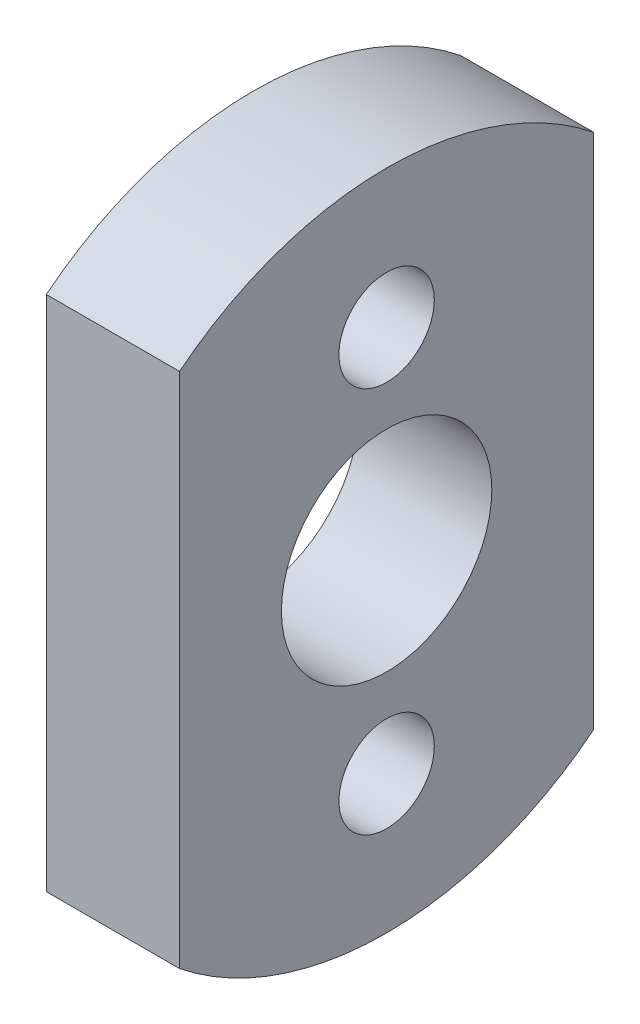
ISO-10303-21;
HEADER;
FILE_DESCRIPTION(('STEP AP214'),'2;1');
FILE_NAME('part.step','',(''),(''),'','','');
FILE_SCHEMA(('AUTOMOTIVE_DESIGN { 1 0 10303 214 1 1 1 1 }'));
ENDSEC;
DATA;
#1=APPLICATION_CONTEXT('core data for automotive mechanical design processes');
#2=APPLICATION_PROTOCOL_DEFINITION('international standard','automotive_design',2000,#1);
#3=PRODUCT_CONTEXT('',#1,'mechanical');
#4=PRODUCT('Part','Part','',(#3));
#5=PRODUCT_RELATED_PRODUCT_CATEGORY('part','',(#4));
#6=PRODUCT_DEFINITION_FORMATION('','',#4);
#7=PRODUCT_DEFINITION_CONTEXT('part definition',#1,'design');
#8=PRODUCT_DEFINITION('design','',#6,#7);
#9=PRODUCT_DEFINITION_SHAPE('','',#8);
#10=(LENGTH_UNIT() NAMED_UNIT(*) SI_UNIT(.MILLI.,.METRE.));
#11=(NAMED_UNIT(*) PLANE_ANGLE_UNIT() SI_UNIT($,.RADIAN.));
#12=(NAMED_UNIT(*) SI_UNIT($,.STERADIAN.) SOLID_ANGLE_UNIT());
#13=UNCERTAINTY_MEASURE_WITH_UNIT(LENGTH_MEASURE(1.E-05),#10,'distance_accuracy_value','');
#14=(GEOMETRIC_REPRESENTATION_CONTEXT(3) GLOBAL_UNCERTAINTY_ASSIGNED_CONTEXT((#13)) GLOBAL_UNIT_ASSIGNED_CONTEXT((#10,
#11,#12)) REPRESENTATION_CONTEXT('',''));
#15=CARTESIAN_POINT('',(0.,0.,0.));
#16=DIRECTION('',(0.,0.,1.));
#17=DIRECTION('',(1.,0.,0.));
#18=AXIS2_PLACEMENT_3D('',#15,#16,#17);
#19=CARTESIAN_POINT('',(4.826,0.,0.));
#20=DIRECTION('',(-1.,0.,0.));
#21=DIRECTION('',(0.,0.,1.));
#22=AXIS2_PLACEMENT_3D('',#19,#20,#21);
#23=PLANE('',#22);
#24=CARTESIAN_POINT('',(4.826,0.,0.));
#25=DIRECTION('',(1.,0.,0.));
#26=DIRECTION('',(0.,0.,1.));
#27=AXIS2_PLACEMENT_3D('',#24,#25,#26);
#28=CIRCLE('',#27,12.);
#29=CARTESIAN_POINT('',(4.826,9.3674969975976,-7.5));
#30=VERTEX_POINT('',#29);
#31=CARTESIAN_POINT('',(4.826,9.3674969975976,7.5));
#32=VERTEX_POINT('',#31);
#33=EDGE_CURVE('E90',#30,#32,#28,.T.);
#34=ORIENTED_EDGE('',*,*,#33,.T.);
#35=DIRECTION('',(0.,-1.,0.));
#36=VECTOR('',#35,1.);
#37=CARTESIAN_POINT('',(4.826,9.3674969975976,7.5));
#38=LINE('',#37,#36);
#39=CARTESIAN_POINT('',(4.826,-9.3674969975976,7.5));
#40=VERTEX_POINT('',#39);
#41=EDGE_CURVE('E85',#32,#40,#38,.T.);
#42=ORIENTED_EDGE('',*,*,#41,.T.);
#43=CARTESIAN_POINT('',(4.826,0.,0.));
#44=DIRECTION('',(1.,0.,0.));
#45=DIRECTION('',(0.,0.,-1.));
#46=AXIS2_PLACEMENT_3D('',#43,#44,#45);
#47=CIRCLE('',#46,12.);
#48=CARTESIAN_POINT('',(4.826,-9.3674969975976,-7.5));
#49=VERTEX_POINT('',#48);
#50=EDGE_CURVE('E88',#40,#49,#47,.T.);
#51=ORIENTED_EDGE('',*,*,#50,.T.);
#52=DIRECTION('',(0.,1.,0.));
#53=VECTOR('',#52,1.);
#54=CARTESIAN_POINT('',(4.826,9.3674969975976,-7.5));
#55=LINE('',#54,#53);
#56=EDGE_CURVE('E55',#49,#30,#55,.T.);
#57=ORIENTED_EDGE('',*,*,#56,.T.);
#58=EDGE_LOOP('',(#34,#42,#51,#57));
#59=FACE_BOUND('',#58,.T.);
#60=CARTESIAN_POINT('',(4.826,7.,0.));
#61=DIRECTION('',(1.,0.,0.));
#62=DIRECTION('',(0.,0.,-1.));
#63=AXIS2_PLACEMENT_3D('',#60,#61,#62);
#64=CIRCLE('',#63,1.7272);
#65=CARTESIAN_POINT('',(4.826,7.,-1.7272));
#66=VERTEX_POINT('',#65);
#67=EDGE_CURVE('E107',#66,#66,#64,.T.);
#68=ORIENTED_EDGE('',*,*,#67,.F.);
#69=EDGE_LOOP('',(#68));
#70=FACE_BOUND('',#69,.T.);
#71=CARTESIAN_POINT('',(4.826,-7.,0.));
#72=DIRECTION('',(1.,0.,0.));
#73=DIRECTION('',(0.,0.,-1.));
#74=AXIS2_PLACEMENT_3D('',#71,#72,#73);
#75=CIRCLE('',#74,1.7272);
#76=CARTESIAN_POINT('',(4.826,-7.,-1.7272));
#77=VERTEX_POINT('',#76);
#78=EDGE_CURVE('E134',#77,#77,#75,.T.);
#79=ORIENTED_EDGE('',*,*,#78,.F.);
#80=EDGE_LOOP('',(#79));
#81=FACE_BOUND('',#80,.T.);
#82=CARTESIAN_POINT('',(4.826,0.,0.));
#83=DIRECTION('',(1.,0.,0.));
#84=DIRECTION('',(0.,0.,-1.));
#85=AXIS2_PLACEMENT_3D('',#82,#83,#84);
#86=CIRCLE('',#85,3.81);
#87=CARTESIAN_POINT('',(4.826,0.,-3.81));
#88=VERTEX_POINT('',#87);
#89=EDGE_CURVE('E141',#88,#88,#86,.T.);
#90=ORIENTED_EDGE('',*,*,#89,.F.);
#91=EDGE_LOOP('',(#90));
#92=FACE_BOUND('',#91,.T.);
#93=ADVANCED_FACE('F38',(#59,#70,#81,#92),#23,.F.);
#94=CARTESIAN_POINT('',(0.,0.,0.));
#95=DIRECTION('',(-1.,0.,0.));
#96=DIRECTION('',(0.,0.,1.));
#97=AXIS2_PLACEMENT_3D('',#94,#95,#96);
#98=PLANE('',#97);
#99=CARTESIAN_POINT('',(0.,-7.,0.));
#100=DIRECTION('',(1.,0.,0.));
#101=DIRECTION('',(0.,0.,-1.));
#102=AXIS2_PLACEMENT_3D('',#99,#100,#101);
#103=CIRCLE('',#102,1.7272);
#104=CARTESIAN_POINT('',(0.,-7.,-1.7272));
#105=VERTEX_POINT('',#104);
#106=EDGE_CURVE('E136',#105,#105,#103,.T.);
#107=ORIENTED_EDGE('',*,*,#106,.T.);
#108=EDGE_LOOP('',(#107));
#109=FACE_BOUND('',#108,.T.);
#110=CARTESIAN_POINT('',(0.,0.,0.));
#111=DIRECTION('',(1.,0.,0.));
#112=DIRECTION('',(0.,0.,1.));
#113=AXIS2_PLACEMENT_3D('',#110,#111,#112);
#114=CIRCLE('',#113,12.);
#115=CARTESIAN_POINT('',(0.,9.3674969975976,-7.5));
#116=VERTEX_POINT('',#115);
#117=CARTESIAN_POINT('',(0.,9.3674969975976,7.5));
#118=VERTEX_POINT('',#117);
#119=EDGE_CURVE('E102',#116,#118,#114,.T.);
#120=ORIENTED_EDGE('',*,*,#119,.F.);
#121=DIRECTION('',(0.,1.,0.));
#122=VECTOR('',#121,1.);
#123=CARTESIAN_POINT('',(0.,9.3674969975976,-7.5));
#124=LINE('',#123,#122);
#125=CARTESIAN_POINT('',(0.,-9.3674969975976,-7.5));
#126=VERTEX_POINT('',#125);
#127=EDGE_CURVE('E78',#126,#116,#124,.T.);
#128=ORIENTED_EDGE('',*,*,#127,.F.);
#129=CARTESIAN_POINT('',(0.,0.,0.));
#130=DIRECTION('',(1.,0.,0.));
#131=DIRECTION('',(0.,0.,-1.));
#132=AXIS2_PLACEMENT_3D('',#129,#130,#131);
#133=CIRCLE('',#132,12.);
#134=CARTESIAN_POINT('',(0.,-9.3674969975976,7.5));
#135=VERTEX_POINT('',#134);
#136=EDGE_CURVE('E72',#135,#126,#133,.T.);
#137=ORIENTED_EDGE('',*,*,#136,.F.);
#138=DIRECTION('',(0.,-1.,0.));
#139=VECTOR('',#138,1.);
#140=CARTESIAN_POINT('',(0.,9.3674969975976,7.5));
#141=LINE('',#140,#139);
#142=EDGE_CURVE('E94',#118,#135,#141,.T.);
#143=ORIENTED_EDGE('',*,*,#142,.F.);
#144=EDGE_LOOP('',(#120,#128,#137,#143));
#145=FACE_BOUND('',#144,.T.);
#146=CARTESIAN_POINT('',(0.,7.,0.));
#147=DIRECTION('',(1.,0.,0.));
#148=DIRECTION('',(0.,0.,-1.));
#149=AXIS2_PLACEMENT_3D('',#146,#147,#148);
#150=CIRCLE('',#149,1.7272);
#151=CARTESIAN_POINT('',(0.,7.,-1.7272));
#152=VERTEX_POINT('',#151);
#153=EDGE_CURVE('E129',#152,#152,#150,.T.);
#154=ORIENTED_EDGE('',*,*,#153,.T.);
#155=EDGE_LOOP('',(#154));
#156=FACE_BOUND('',#155,.T.);
#157=CARTESIAN_POINT('',(0.,0.,0.));
#158=DIRECTION('',(1.,0.,0.));
#159=DIRECTION('',(0.,0.,-1.));
#160=AXIS2_PLACEMENT_3D('',#157,#158,#159);
#161=CIRCLE('',#160,3.81);
#162=CARTESIAN_POINT('',(0.,0.,-3.81));
#163=VERTEX_POINT('',#162);
#164=EDGE_CURVE('E143',#163,#163,#161,.T.);
#165=ORIENTED_EDGE('',*,*,#164,.T.);
#166=EDGE_LOOP('',(#165));
#167=FACE_BOUND('',#166,.T.);
#168=ADVANCED_FACE('F125',(#109,#145,#156,#167),#98,.T.);
#169=CARTESIAN_POINT('',(4.826,0.,0.));
#170=DIRECTION('',(-1.,0.,0.));
#171=DIRECTION('',(0.,0.,1.));
#172=AXIS2_PLACEMENT_3D('',#169,#170,#171);
#173=CYLINDRICAL_SURFACE('',#172,12.);
#174=ORIENTED_EDGE('',*,*,#119,.T.);
#175=DIRECTION('',(-1.,0.,0.));
#176=VECTOR('',#175,1.);
#177=CARTESIAN_POINT('',(4.826,9.3674969975976,7.5));
#178=LINE('',#177,#176);
#179=EDGE_CURVE('E12',#32,#118,#178,.T.);
#180=ORIENTED_EDGE('',*,*,#179,.F.);
#181=ORIENTED_EDGE('',*,*,#33,.F.);
#182=DIRECTION('',(-1.,0.,0.));
#183=VECTOR('',#182,1.);
#184=CARTESIAN_POINT('',(4.826,9.3674969975976,-7.5));
#185=LINE('',#184,#183);
#186=EDGE_CURVE('E98',#30,#116,#185,.T.);
#187=ORIENTED_EDGE('',*,*,#186,.T.);
#188=EDGE_LOOP('',(#174,#180,#181,#187));
#189=FACE_BOUND('',#188,.T.);
#190=ADVANCED_FACE('F40',(#189),#173,.T.);
#191=CARTESIAN_POINT('',(4.826,9.3674969975976,7.5));
#192=DIRECTION('',(0.,0.,-1.));
#193=DIRECTION('',(-1.,0.,0.));
#194=AXIS2_PLACEMENT_3D('',#191,#192,#193);
#195=PLANE('',#194);
#196=ORIENTED_EDGE('',*,*,#142,.T.);
#197=DIRECTION('',(-1.,0.,0.));
#198=VECTOR('',#197,1.);
#199=CARTESIAN_POINT('',(4.826,-9.3674969975976,7.5));
#200=LINE('',#199,#198);
#201=EDGE_CURVE('E47',#40,#135,#200,.T.);
#202=ORIENTED_EDGE('',*,*,#201,.F.);
#203=ORIENTED_EDGE('',*,*,#41,.F.);
#204=ORIENTED_EDGE('',*,*,#179,.T.);
#205=EDGE_LOOP('',(#196,#202,#203,#204));
#206=FACE_BOUND('',#205,.T.);
#207=ADVANCED_FACE('F93',(#206),#195,.F.);
#208=CARTESIAN_POINT('',(4.826,0.,0.));
#209=DIRECTION('',(-1.,0.,0.));
#210=DIRECTION('',(0.,0.,1.));
#211=AXIS2_PLACEMENT_3D('',#208,#209,#210);
#212=CYLINDRICAL_SURFACE('',#211,12.);
#213=ORIENTED_EDGE('',*,*,#136,.T.);
#214=DIRECTION('',(-1.,0.,0.));
#215=VECTOR('',#214,1.);
#216=CARTESIAN_POINT('',(4.826,-9.3674969975976,-7.5));
#217=LINE('',#216,#215);
#218=EDGE_CURVE('E95',#49,#126,#217,.T.);
#219=ORIENTED_EDGE('',*,*,#218,.F.);
#220=ORIENTED_EDGE('',*,*,#50,.F.);
#221=ORIENTED_EDGE('',*,*,#201,.T.);
#222=EDGE_LOOP('',(#213,#219,#220,#221));
#223=FACE_BOUND('',#222,.T.);
#224=ADVANCED_FACE('F96',(#223),#212,.T.);
#225=CARTESIAN_POINT('',(4.826,9.3674969975976,-7.5));
#226=DIRECTION('',(0.,0.,1.));
#227=DIRECTION('',(1.,0.,0.));
#228=AXIS2_PLACEMENT_3D('',#225,#226,#227);
#229=PLANE('',#228);
#230=ORIENTED_EDGE('',*,*,#127,.T.);
#231=ORIENTED_EDGE('',*,*,#186,.F.);
#232=ORIENTED_EDGE('',*,*,#56,.F.);
#233=ORIENTED_EDGE('',*,*,#218,.T.);
#234=EDGE_LOOP('',(#230,#231,#232,#233));
#235=FACE_BOUND('',#234,.T.);
#236=ADVANCED_FACE('F122',(#235),#229,.F.);
#237=CARTESIAN_POINT('',(4.826,7.,0.));
#238=DIRECTION('',(-1.,0.,0.));
#239=DIRECTION('',(0.,0.,1.));
#240=AXIS2_PLACEMENT_3D('',#237,#238,#239);
#241=CYLINDRICAL_SURFACE('',#240,1.7272);
#242=ORIENTED_EDGE('',*,*,#67,.T.);
#243=EDGE_LOOP('',(#242));
#244=FACE_BOUND('',#243,.T.);
#245=ORIENTED_EDGE('',*,*,#153,.F.);
#246=EDGE_LOOP('',(#245));
#247=FACE_BOUND('',#246,.T.);
#248=ADVANCED_FACE('F162',(#244,#247),#241,.F.);
#249=CARTESIAN_POINT('',(4.826,-7.,0.));
#250=DIRECTION('',(-1.,0.,0.));
#251=DIRECTION('',(0.,0.,1.));
#252=AXIS2_PLACEMENT_3D('',#249,#250,#251);
#253=CYLINDRICAL_SURFACE('',#252,1.7272);
#254=ORIENTED_EDGE('',*,*,#78,.T.);
#255=EDGE_LOOP('',(#254));
#256=FACE_BOUND('',#255,.T.);
#257=ORIENTED_EDGE('',*,*,#106,.F.);
#258=EDGE_LOOP('',(#257));
#259=FACE_BOUND('',#258,.T.);
#260=ADVANCED_FACE('F208',(#256,#259),#253,.F.);
#261=CARTESIAN_POINT('',(4.826,0.,0.));
#262=DIRECTION('',(-1.,0.,0.));
#263=DIRECTION('',(0.,0.,1.));
#264=AXIS2_PLACEMENT_3D('',#261,#262,#263);
#265=CYLINDRICAL_SURFACE('',#264,3.81);
#266=ORIENTED_EDGE('',*,*,#89,.T.);
#267=EDGE_LOOP('',(#266));
#268=FACE_BOUND('',#267,.T.);
#269=ORIENTED_EDGE('',*,*,#164,.F.);
#270=EDGE_LOOP('',(#269));
#271=FACE_BOUND('',#270,.T.);
#272=ADVANCED_FACE('F151',(#268,#271),#265,.F.);
#273=CLOSED_SHELL('',(#93,#168,#190,#207,#224,#236,#248,#260,#272));
#274=MANIFOLD_SOLID_BREP('B2',#273);
#275=ADVANCED_BREP_SHAPE_REPRESENTATION('',(#18,#274),#14);
#276=SHAPE_DEFINITION_REPRESENTATION(#9,#275);
ENDSEC;
END-ISO-10303-21;
